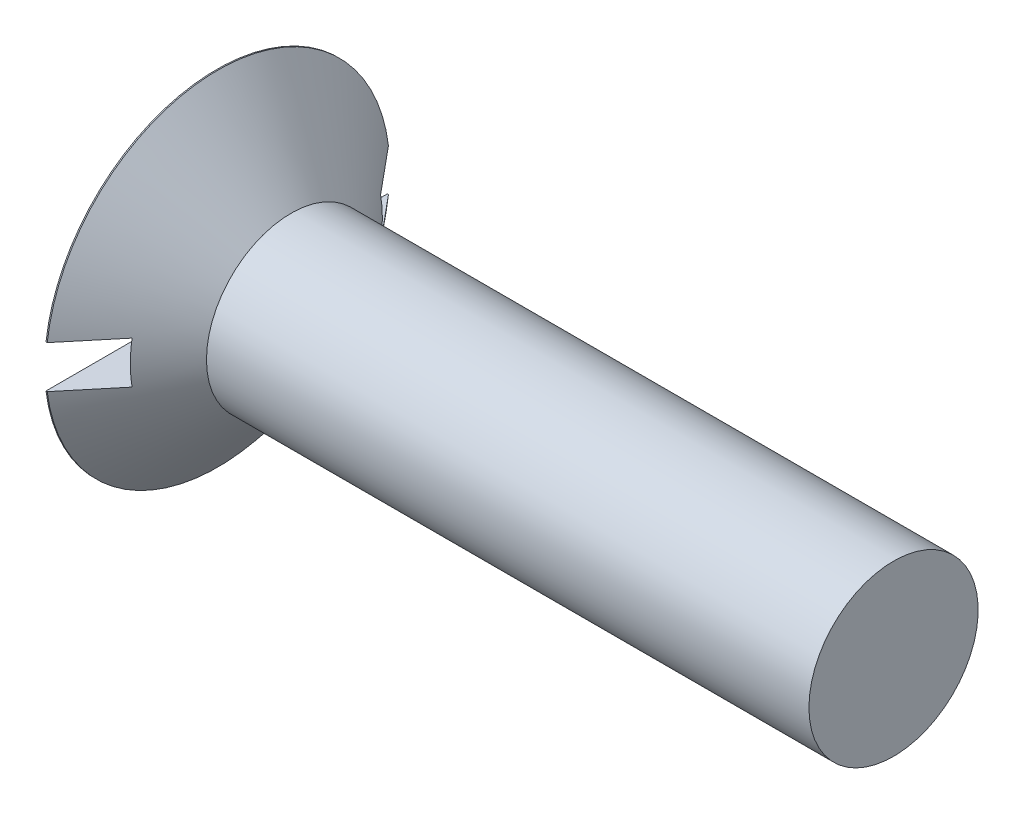
ISO-10303-21;
HEADER;
FILE_DESCRIPTION(('STEP AP214'),'2;1');
FILE_NAME('part.step','',(''),(''),'','','');
FILE_SCHEMA(('AUTOMOTIVE_DESIGN { 1 0 10303 214 1 1 1 1 }'));
ENDSEC;
DATA;
#1=APPLICATION_CONTEXT('core data for automotive mechanical design processes');
#2=APPLICATION_PROTOCOL_DEFINITION('international standard','automotive_design',2000,#1);
#3=PRODUCT_CONTEXT('',#1,'mechanical');
#4=PRODUCT('Part','Part','',(#3));
#5=PRODUCT_RELATED_PRODUCT_CATEGORY('part','',(#4));
#6=PRODUCT_DEFINITION_FORMATION('','',#4);
#7=PRODUCT_DEFINITION_CONTEXT('part definition',#1,'design');
#8=PRODUCT_DEFINITION('design','',#6,#7);
#9=PRODUCT_DEFINITION_SHAPE('','',#8);
#10=(LENGTH_UNIT() NAMED_UNIT(*) SI_UNIT(.MILLI.,.METRE.));
#11=(NAMED_UNIT(*) PLANE_ANGLE_UNIT() SI_UNIT($,.RADIAN.));
#12=(NAMED_UNIT(*) SI_UNIT($,.STERADIAN.) SOLID_ANGLE_UNIT());
#13=UNCERTAINTY_MEASURE_WITH_UNIT(LENGTH_MEASURE(1.E-05),#10,'distance_accuracy_value','');
#14=(GEOMETRIC_REPRESENTATION_CONTEXT(3) GLOBAL_UNCERTAINTY_ASSIGNED_CONTEXT((#13)) GLOBAL_UNIT_ASSIGNED_CONTEXT((#10,
#11,#12)) REPRESENTATION_CONTEXT('',''));
#15=CARTESIAN_POINT('',(0.,0.,0.));
#16=DIRECTION('',(0.,0.,1.));
#17=DIRECTION('',(1.,0.,0.));
#18=AXIS2_PLACEMENT_3D('',#15,#16,#17);
#19=CARTESIAN_POINT('',(2.2352,1.1938,-9.67739999999999));
#20=DIRECTION('',(-1.,0.,0.));
#21=DIRECTION('',(0.,0.,1.));
#22=AXIS2_PLACEMENT_3D('',#19,#20,#21);
#23=PLANE('',#22);
#24=DIRECTION('',(0.,-1.,0.));
#25=VECTOR('',#24,1.);
#26=CARTESIAN_POINT('',(2.2352,1.19379999999995,4.93366687898089));
#27=LINE('',#26,#25);
#28=CARTESIAN_POINT('',(2.2352,0.93915286624202,4.93366687898089));
#29=VERTEX_POINT('',#28);
#30=CARTESIAN_POINT('',(2.2352,-0.939152866242055,4.93366687898089));
#31=VERTEX_POINT('',#30);
#32=EDGE_CURVE('E316',#29,#31,#27,.T.);
#33=ORIENTED_EDGE('',*,*,#32,.T.);
#34=DIRECTION('',(0.,0.,-1.));
#35=VECTOR('',#34,1.);
#36=CARTESIAN_POINT('',(2.2352,-0.939152866242006,-9.6774));
#37=LINE('',#36,#35);
#38=CARTESIAN_POINT('',(2.2352,-0.939152866242041,0.939152866242038));
#39=VERTEX_POINT('',#38);
#40=EDGE_CURVE('E163',#31,#39,#37,.T.);
#41=ORIENTED_EDGE('',*,*,#40,.T.);
#42=DIRECTION('',(0.,-1.,0.));
#43=VECTOR('',#42,1.);
#44=CARTESIAN_POINT('',(2.2352,1.1938,0.939152866242037));
#45=LINE('',#44,#43);
#46=CARTESIAN_POINT('',(2.2352,-1.1938,0.939152866242037));
#47=VERTEX_POINT('',#46);
#48=EDGE_CURVE('E40',#39,#47,#45,.T.);
#49=ORIENTED_EDGE('',*,*,#48,.T.);
#50=DIRECTION('',(0.,0.,1.));
#51=VECTOR('',#50,1.);
#52=CARTESIAN_POINT('',(2.2352,-1.1938,-9.6774));
#53=LINE('',#52,#51);
#54=CARTESIAN_POINT('',(2.2352,-1.1938,6.99215244623282));
#55=VERTEX_POINT('',#54);
#56=EDGE_CURVE('E55',#47,#55,#53,.T.);
#57=ORIENTED_EDGE('',*,*,#56,.T.);
#58=CARTESIAN_POINT('',(2.2352,0.,0.));
#59=DIRECTION('',(-1.,0.,0.));
#60=DIRECTION('',(0.,0.,1.));
#61=AXIS2_PLACEMENT_3D('',#58,#59,#60);
#62=CIRCLE('',#61,7.09333167639577);
#63=CARTESIAN_POINT('',(2.2352,1.1938,6.99215244623282));
#64=VERTEX_POINT('',#63);
#65=EDGE_CURVE('E264',#64,#55,#62,.F.);
#66=ORIENTED_EDGE('',*,*,#65,.F.);
#67=DIRECTION('',(0.,0.,-1.));
#68=VECTOR('',#67,1.);
#69=CARTESIAN_POINT('',(2.2352,1.1938,9.6774));
#70=LINE('',#69,#68);
#71=CARTESIAN_POINT('',(2.2352,1.1938,0.939152866242037));
#72=VERTEX_POINT('',#71);
#73=EDGE_CURVE('E228',#64,#72,#70,.T.);
#74=ORIENTED_EDGE('',*,*,#73,.T.);
#75=CARTESIAN_POINT('',(2.2352,0.939152866242034,0.939152866242037));
#76=VERTEX_POINT('',#75);
#77=EDGE_CURVE('E11',#72,#76,#45,.T.);
#78=ORIENTED_EDGE('',*,*,#77,.T.);
#79=DIRECTION('',(0.,0.,1.));
#80=VECTOR('',#79,1.);
#81=CARTESIAN_POINT('',(2.2352,0.939152866242072,-9.67739999999999));
#82=LINE('',#81,#80);
#83=EDGE_CURVE('E317',#76,#29,#82,.T.);
#84=ORIENTED_EDGE('',*,*,#83,.T.);
#85=EDGE_LOOP('',(#33,#41,#49,#57,#66,#74,#78,#84));
#86=FACE_BOUND('',#85,.T.);
#87=ADVANCED_FACE('F32',(#86),#23,.T.);
#88=DIRECTION('',(0.,1.,0.));
#89=VECTOR('',#88,1.);
#90=CARTESIAN_POINT('',(2.2352,1.1938,-0.939152866242039));
#91=LINE('',#90,#89);
#92=CARTESIAN_POINT('',(2.2352,-1.1938,-0.939152866242039));
#93=VERTEX_POINT('',#92);
#94=CARTESIAN_POINT('',(2.2352,-0.939152866242035,-0.939152866242038));
#95=VERTEX_POINT('',#94);
#96=EDGE_CURVE('E389',#93,#95,#91,.T.);
#97=ORIENTED_EDGE('',*,*,#96,.T.);
#98=DIRECTION('',(0.,0.,-1.));
#99=VECTOR('',#98,1.);
#100=CARTESIAN_POINT('',(2.2352,-0.939152866242006,-9.6774));
#101=LINE('',#100,#99);
#102=CARTESIAN_POINT('',(2.2352,-0.939152866242022,-4.9336668789809));
#103=VERTEX_POINT('',#102);
#104=EDGE_CURVE('E189',#95,#103,#101,.T.);
#105=ORIENTED_EDGE('',*,*,#104,.T.);
#106=DIRECTION('',(0.,1.,0.));
#107=VECTOR('',#106,1.);
#108=CARTESIAN_POINT('',(2.2352,1.19379999999998,-4.93366687898089));
#109=LINE('',#108,#107);
#110=CARTESIAN_POINT('',(2.2352,0.939152866242055,-4.93366687898089));
#111=VERTEX_POINT('',#110);
#112=EDGE_CURVE('E332',#103,#111,#109,.T.);
#113=ORIENTED_EDGE('',*,*,#112,.T.);
#114=DIRECTION('',(0.,0.,1.));
#115=VECTOR('',#114,1.);
#116=CARTESIAN_POINT('',(2.2352,0.939152866242072,-9.67739999999999));
#117=LINE('',#116,#115);
#118=CARTESIAN_POINT('',(2.2352,0.939152866242041,-0.939152866242038));
#119=VERTEX_POINT('',#118);
#120=EDGE_CURVE('E322',#111,#119,#117,.T.);
#121=ORIENTED_EDGE('',*,*,#120,.T.);
#122=CARTESIAN_POINT('',(2.2352,1.1938,-0.939152866242035));
#123=VERTEX_POINT('',#122);
#124=EDGE_CURVE('E47',#119,#123,#91,.T.);
#125=ORIENTED_EDGE('',*,*,#124,.T.);
#126=CARTESIAN_POINT('',(2.2352,1.1938,-6.99215244623282));
#127=VERTEX_POINT('',#126);
#128=EDGE_CURVE('E231',#123,#127,#70,.T.);
#129=ORIENTED_EDGE('',*,*,#128,.T.);
#130=CARTESIAN_POINT('',(2.2352,-1.1938,-6.99215244623282));
#131=VERTEX_POINT('',#130);
#132=EDGE_CURVE('E268',#131,#127,#62,.F.);
#133=ORIENTED_EDGE('',*,*,#132,.F.);
#134=EDGE_CURVE('E232',#131,#93,#53,.T.);
#135=ORIENTED_EDGE('',*,*,#134,.T.);
#136=EDGE_LOOP('',(#97,#105,#113,#121,#125,#129,#133,#135));
#137=FACE_BOUND('',#136,.T.);
#138=ADVANCED_FACE('F311',(#137),#23,.T.);
#139=CARTESIAN_POINT('',(8.69008083333333,0.,0.497178541666667));
#140=DIRECTION('',(-0.0683113918583954,0.,-0.997664048536565));
#141=DIRECTION('',(-0.997664048536565,0.,0.0683113918583954));
#142=AXIS2_PLACEMENT_3D('',#139,#140,#141);
#143=PLANE('',#142);
#144=ORIENTED_EDGE('',*,*,#48,.F.);
#145=DIRECTION('',(0.995344390972083,0.0681525618022289,-0.0681525618022287));
#146=VECTOR('',#145,1.);
#147=CARTESIAN_POINT('',(8.72380707400527,-0.494869260856328,0.494869260856327));
#148=LINE('',#147,#146);
#149=CARTESIAN_POINT('',(7.9756,-0.546100000000002,0.546099999999999));
#150=VERTEX_POINT('',#149);
#151=EDGE_CURVE('E161',#39,#150,#148,.T.);
#152=ORIENTED_EDGE('',*,*,#151,.T.);
#153=DIRECTION('',(0.793328420082592,0.606365671400707,-0.0543202580629801));
#154=VECTOR('',#153,1.);
#155=CARTESIAN_POINT('',(0.,-6.6421,1.0922));
#156=LINE('',#155,#154);
#157=CARTESIAN_POINT('',(0.,-6.6421,1.0922));
#158=VERTEX_POINT('',#157);
#159=EDGE_CURVE('E186',#158,#150,#156,.T.);
#160=ORIENTED_EDGE('',*,*,#159,.F.);
#161=DIRECTION('',(0.,-1.,0.));
#162=VECTOR('',#161,1.);
#163=CARTESIAN_POINT('',(0.,6.6421,1.0922));
#164=LINE('',#163,#162);
#165=CARTESIAN_POINT('',(0.,-1.1938,1.0922));
#166=VERTEX_POINT('',#165);
#167=EDGE_CURVE('E344',#166,#158,#164,.T.);
#168=ORIENTED_EDGE('',*,*,#167,.F.);
#169=DIRECTION('',(0.997664048536565,0.,-0.0683113918583954));
#170=VECTOR('',#169,1.);
#171=CARTESIAN_POINT('',(2.95873739744039,-1.1938,0.889611292850418));
#172=LINE('',#171,#170);
#173=EDGE_CURVE('E223',#166,#47,#172,.T.);
#174=ORIENTED_EDGE('',*,*,#173,.T.);
#175=EDGE_LOOP('',(#144,#152,#160,#168,#174));
#176=FACE_BOUND('',#175,.T.);
#177=ADVANCED_FACE('F184',(#176),#143,.T.);
#178=DIRECTION('',(0.793328420082592,-0.606365671400707,-0.05432025806298));
#179=VECTOR('',#178,1.);
#180=CARTESIAN_POINT('',(0.,6.6421,1.0922));
#181=LINE('',#180,#179);
#182=CARTESIAN_POINT('',(0.,6.6421,1.0922));
#183=VERTEX_POINT('',#182);
#184=CARTESIAN_POINT('',(7.9756,0.546100000000001,0.5461));
#185=VERTEX_POINT('',#184);
#186=EDGE_CURVE('E209',#183,#185,#181,.T.);
#187=ORIENTED_EDGE('',*,*,#186,.T.);
#188=DIRECTION('',(-0.995344390972083,0.0681525618022283,0.0681525618022286));
#189=VECTOR('',#188,1.);
#190=CARTESIAN_POINT('',(8.72380707400527,0.494869260856325,0.494869260856327));
#191=LINE('',#190,#189);
#192=EDGE_CURVE('E328',#185,#76,#191,.T.);
#193=ORIENTED_EDGE('',*,*,#192,.T.);
#194=ORIENTED_EDGE('',*,*,#77,.F.);
#195=DIRECTION('',(-0.997664048536565,0.,0.0683113918583954));
#196=VECTOR('',#195,1.);
#197=CARTESIAN_POINT('',(1.63967255629894,1.1938,0.979929426877621));
#198=LINE('',#197,#196);
#199=CARTESIAN_POINT('',(0.,1.1938,1.0922));
#200=VERTEX_POINT('',#199);
#201=EDGE_CURVE('E225',#72,#200,#198,.T.);
#202=ORIENTED_EDGE('',*,*,#201,.T.);
#203=EDGE_CURVE('E345',#183,#200,#164,.T.);
#204=ORIENTED_EDGE('',*,*,#203,.F.);
#205=EDGE_LOOP('',(#187,#193,#194,#202,#204));
#206=FACE_BOUND('',#205,.T.);
#207=ADVANCED_FACE('F365',(#206),#143,.T.);
#208=CARTESIAN_POINT('',(8.69008083333333,0.,-0.497178541666667));
#209=DIRECTION('',(-0.0683113918583953,0.,0.997664048536565));
#210=DIRECTION('',(0.997664048536565,0.,0.0683113918583953));
#211=AXIS2_PLACEMENT_3D('',#208,#209,#210);
#212=PLANE('',#211);
#213=DIRECTION('',(0.793328420082592,0.606365671400707,0.0543202580629799));
#214=VECTOR('',#213,1.);
#215=CARTESIAN_POINT('',(0.,-6.6421,-1.0922));
#216=LINE('',#215,#214);
#217=CARTESIAN_POINT('',(0.,-6.6421,-1.0922));
#218=VERTEX_POINT('',#217);
#219=CARTESIAN_POINT('',(7.9756,-0.5461,-0.5461));
#220=VERTEX_POINT('',#219);
#221=EDGE_CURVE('E204',#218,#220,#216,.T.);
#222=ORIENTED_EDGE('',*,*,#221,.T.);
#223=DIRECTION('',(-0.995344390972083,-0.0681525618022284,-0.0681525618022285));
#224=VECTOR('',#223,1.);
#225=CARTESIAN_POINT('',(8.72380707400527,-0.494869260856325,-0.494869260856327));
#226=LINE('',#225,#224);
#227=EDGE_CURVE('E335',#220,#95,#226,.T.);
#228=ORIENTED_EDGE('',*,*,#227,.T.);
#229=ORIENTED_EDGE('',*,*,#96,.F.);
#230=DIRECTION('',(-0.997664048536565,0.,-0.0683113918583953));
#231=VECTOR('',#230,1.);
#232=CARTESIAN_POINT('',(1.63967255629895,-1.1938,-0.979929426877619));
#233=LINE('',#232,#231);
#234=CARTESIAN_POINT('',(0.,-1.1938,-1.0922));
#235=VERTEX_POINT('',#234);
#236=EDGE_CURVE('E219',#93,#235,#233,.T.);
#237=ORIENTED_EDGE('',*,*,#236,.T.);
#238=DIRECTION('',(0.,1.,0.));
#239=VECTOR('',#238,1.);
#240=CARTESIAN_POINT('',(0.,-6.6421,-1.0922));
#241=LINE('',#240,#239);
#242=EDGE_CURVE('E207',#218,#235,#241,.T.);
#243=ORIENTED_EDGE('',*,*,#242,.F.);
#244=EDGE_LOOP('',(#222,#228,#229,#237,#243));
#245=FACE_BOUND('',#244,.T.);
#246=ADVANCED_FACE('F388',(#245),#212,.T.);
#247=ORIENTED_EDGE('',*,*,#124,.F.);
#248=DIRECTION('',(0.995344390972083,-0.0681525618022288,0.0681525618022285));
#249=VECTOR('',#248,1.);
#250=CARTESIAN_POINT('',(8.72380707400527,0.494869260856329,-0.494869260856327));
#251=LINE('',#250,#249);
#252=CARTESIAN_POINT('',(7.9756,0.546100000000002,-0.546099999999998));
#253=VERTEX_POINT('',#252);
#254=EDGE_CURVE('E318',#119,#253,#251,.T.);
#255=ORIENTED_EDGE('',*,*,#254,.T.);
#256=DIRECTION('',(0.793328420082592,-0.606365671400707,0.0543202580629799));
#257=VECTOR('',#256,1.);
#258=CARTESIAN_POINT('',(0.,6.6421,-1.0922));
#259=LINE('',#258,#257);
#260=CARTESIAN_POINT('',(0.,6.6421,-1.0922));
#261=VERTEX_POINT('',#260);
#262=EDGE_CURVE('E198',#261,#253,#259,.T.);
#263=ORIENTED_EDGE('',*,*,#262,.F.);
#264=CARTESIAN_POINT('',(0.,1.1938,-1.0922));
#265=VERTEX_POINT('',#264);
#266=EDGE_CURVE('E203',#265,#261,#241,.T.);
#267=ORIENTED_EDGE('',*,*,#266,.F.);
#268=DIRECTION('',(0.997664048536565,0.,0.0683113918583953));
#269=VECTOR('',#268,1.);
#270=CARTESIAN_POINT('',(2.95873739744039,1.1938,-0.88961129285042));
#271=LINE('',#270,#269);
#272=EDGE_CURVE('E221',#265,#123,#271,.T.);
#273=ORIENTED_EDGE('',*,*,#272,.T.);
#274=EDGE_LOOP('',(#247,#255,#263,#267,#273));
#275=FACE_BOUND('',#274,.T.);
#276=ADVANCED_FACE('F375',(#275),#212,.T.);
#277=CARTESIAN_POINT('',(0.,0.,0.));
#278=DIRECTION('',(-1.,0.,0.));
#279=DIRECTION('',(0.,0.,1.));
#280=AXIS2_PLACEMENT_3D('',#277,#278,#279);
#281=PLANE('',#280);
#282=DIRECTION('',(0.,0.,1.));
#283=VECTOR('',#282,1.);
#284=CARTESIAN_POINT('',(0.,6.6421,-1.0922));
#285=LINE('',#284,#283);
#286=EDGE_CURVE('E341',#261,#183,#285,.T.);
#287=ORIENTED_EDGE('',*,*,#286,.T.);
#288=ORIENTED_EDGE('',*,*,#203,.T.);
#289=DIRECTION('',(0.,0.,-1.));
#290=VECTOR('',#289,1.);
#291=CARTESIAN_POINT('',(0.,1.1938,9.6774));
#292=LINE('',#291,#290);
#293=CARTESIAN_POINT('',(0.,1.1938,9.60348438432634));
#294=VERTEX_POINT('',#293);
#295=EDGE_CURVE('E236',#294,#200,#292,.T.);
#296=ORIENTED_EDGE('',*,*,#295,.F.);
#297=CARTESIAN_POINT('',(0.,0.,0.));
#298=DIRECTION('',(-1.,0.,0.));
#299=DIRECTION('',(0.,0.,1.));
#300=AXIS2_PLACEMENT_3D('',#297,#298,#299);
#301=CIRCLE('',#300,9.6774);
#302=CARTESIAN_POINT('',(0.,1.1938,-9.60348438432634));
#303=VERTEX_POINT('',#302);
#304=EDGE_CURVE('E263',#294,#303,#301,.T.);
#305=ORIENTED_EDGE('',*,*,#304,.T.);
#306=EDGE_CURVE('E227',#265,#303,#292,.T.);
#307=ORIENTED_EDGE('',*,*,#306,.F.);
#308=ORIENTED_EDGE('',*,*,#266,.T.);
#309=EDGE_LOOP('',(#287,#288,#296,#305,#307,#308));
#310=FACE_BOUND('',#309,.T.);
#311=ADVANCED_FACE('F34',(#310),#281,.T.);
#312=DIRECTION('',(0.,0.,1.));
#313=VECTOR('',#312,1.);
#314=CARTESIAN_POINT('',(0.,-1.1938,-9.6774));
#315=LINE('',#314,#313);
#316=CARTESIAN_POINT('',(0.,-1.1938,9.60348438432634));
#317=VERTEX_POINT('',#316);
#318=EDGE_CURVE('E239',#166,#317,#315,.T.);
#319=ORIENTED_EDGE('',*,*,#318,.F.);
#320=ORIENTED_EDGE('',*,*,#167,.T.);
#321=DIRECTION('',(0.,0.,-1.));
#322=VECTOR('',#321,1.);
#323=CARTESIAN_POINT('',(0.,-6.6421,1.0922));
#324=LINE('',#323,#322);
#325=EDGE_CURVE('E202',#158,#218,#324,.T.);
#326=ORIENTED_EDGE('',*,*,#325,.T.);
#327=ORIENTED_EDGE('',*,*,#242,.T.);
#328=CARTESIAN_POINT('',(0.,-1.1938,-9.60348438432634));
#329=VERTEX_POINT('',#328);
#330=EDGE_CURVE('E240',#329,#235,#315,.T.);
#331=ORIENTED_EDGE('',*,*,#330,.F.);
#332=EDGE_CURVE('E260',#329,#317,#301,.T.);
#333=ORIENTED_EDGE('',*,*,#332,.T.);
#334=EDGE_LOOP('',(#319,#320,#326,#327,#331,#333));
#335=FACE_BOUND('',#334,.T.);
#336=ADVANCED_FACE('F296',(#335),#281,.T.);
#337=CARTESIAN_POINT('',(2.2352,1.1938,9.6774));
#338=DIRECTION('',(0.,1.,0.));
#339=DIRECTION('',(0.,0.,1.));
#340=AXIS2_PLACEMENT_3D('',#337,#338,#339);
#341=PLANE('',#340);
#342=ORIENTED_EDGE('',*,*,#201,.F.);
#343=ORIENTED_EDGE('',*,*,#73,.F.);
#344=CARTESIAN_POINT('',(-9.76654593164914,1.1938,-21.3631259383791));
#345=CARTESIAN_POINT('',(-9.09525937896427,1.1938,-20.5618561872628));
#346=CARTESIAN_POINT('',(-8.42402942184396,1.1938,-19.7605389922674));
#347=CARTESIAN_POINT('',(-7.08174656529873,1.1938,-18.1577081627407));
#348=CARTESIAN_POINT('',(-6.410693672967,1.1938,-17.3561945222694));
#349=CARTESIAN_POINT('',(-5.06835999478434,1.1938,-15.7523090009415));
#350=CARTESIAN_POINT('',(-4.39707943091826,1.1938,-14.9499369342687));
#351=CARTESIAN_POINT('',(-3.05500547673589,1.1938,-13.344832799566));
#352=CARTESIAN_POINT('',(-2.38421207030888,1.1938,-12.5421007450077));
#353=CARTESIAN_POINT('',(-1.08974214453766,1.1938,-10.9914684766259));
#354=CARTESIAN_POINT('',(-0.466012830989507,1.1938,-10.2436123638055));
#355=CARTESIAN_POINT('',(0.468629921489954,1.1938,-9.12096941168539));
#356=CARTESIAN_POINT('',(0.780035340405337,1.1938,-8.74659222952008));
#357=CARTESIAN_POINT('',(1.40235767845507,1.1938,-7.99743946742865));
#358=CARTESIAN_POINT('',(1.7132746034181,1.1938,-7.62266389234697));
#359=CARTESIAN_POINT('',(2.33421374657034,1.1938,-6.87268523520887));
#360=CARTESIAN_POINT('',(2.64423633183312,1.1938,-6.49748245710988));
#361=CARTESIAN_POINT('',(3.26310212902537,1.1938,-5.74607511705371));
#362=CARTESIAN_POINT('',(3.57194528724139,1.1938,-5.36987051076495));
#363=CARTESIAN_POINT('',(4.03353158308518,1.1938,-4.80425158466736));
#364=CARTESIAN_POINT('',(4.18709974598508,1.1938,-4.61551087670477));
#365=CARTESIAN_POINT('',(4.4934425309929,1.1938,-4.23738693696583));
#366=CARTESIAN_POINT('',(4.64621715651197,1.1938,-4.04800370795726));
#367=CARTESIAN_POINT('',(4.95058145187337,1.1938,-3.66830924323743));
#368=CARTESIAN_POINT('',(5.10217120583669,1.1938,-3.47799807499275));
#369=CARTESIAN_POINT('',(5.40351985730696,1.1938,-3.09593308429033));
#370=CARTESIAN_POINT('',(5.55327881261173,1.1938,-2.90417930768568));
#371=CARTESIAN_POINT('',(5.73503949390202,1.1938,-2.66748522542514));
#372=CARTESIAN_POINT('',(5.7685380756654,1.1938,-2.62369463527218));
#373=CARTESIAN_POINT('',(5.83534437577694,1.1938,-2.53596777529053));
#374=CARTESIAN_POINT('',(5.86865209308634,1.1938,-2.49203150467103));
#375=CARTESIAN_POINT('',(5.96825558737328,1.1938,-2.35996763028417));
#376=CARTESIAN_POINT('',(6.03422528026107,1.1938,-2.27159331182579));
#377=CARTESIAN_POINT('',(6.16555986291181,1.1938,-2.09319681022266));
#378=CARTESIAN_POINT('',(6.23091437982306,1.1938,-2.00316697271865));
#379=CARTESIAN_POINT('',(6.35992402493566,1.1938,-1.82192968945906));
#380=CARTESIAN_POINT('',(6.42357962679466,1.1938,-1.73072258267316));
#381=CARTESIAN_POINT('',(6.54895917751627,1.1938,-1.54585737920636));
#382=CARTESIAN_POINT('',(6.61066232471778,1.1938,-1.4521851040837));
#383=CARTESIAN_POINT('',(6.73033793041619,1.1938,-1.2622703295857));
#384=CARTESIAN_POINT('',(6.78830535652416,1.1938,-1.16602460050921));
#385=CARTESIAN_POINT('',(6.87032154010654,1.1938,-1.01940163786976));
#386=CARTESIAN_POINT('',(6.89673746242748,1.1938,-0.970361294352432));
#387=CARTESIAN_POINT('',(6.94753509366566,1.1938,-0.871242137065955));
#388=CARTESIAN_POINT('',(6.97191636263843,1.1938,-0.821163101612474));
#389=CARTESIAN_POINT('',(7.04101569893722,1.1938,-0.669329881550796));
#390=CARTESIAN_POINT('',(7.08187978249657,1.1938,-0.565655074895694));
#391=CARTESIAN_POINT('',(7.12649625042963,1.1938,-0.417525005421813));
#392=CARTESIAN_POINT('',(7.13772030765905,1.1938,-0.375315946700828));
#393=CARTESIAN_POINT('',(7.15690825639771,1.1938,-0.290148086197976));
#394=CARTESIAN_POINT('',(7.16487217380331,1.1938,-0.247189290374345));
#395=CARTESIAN_POINT('',(7.17705987506851,1.1938,-0.160931262036987));
#396=CARTESIAN_POINT('',(7.18130019489879,1.1938,-0.117634405031509));
#397=CARTESIAN_POINT('',(7.18581997140462,1.1938,-0.030832058426957));
#398=CARTESIAN_POINT('',(7.18609962730917,1.1938,0.0126734205679055));
#399=CARTESIAN_POINT('',(7.18267879720996,1.1938,0.0995364340264362));
#400=CARTESIAN_POINT('',(7.17897720385541,1.1938,0.142893923962498));
#401=CARTESIAN_POINT('',(7.16783852752721,1.1938,0.22912857614983));
#402=CARTESIAN_POINT('',(7.16040045523447,1.1938,0.272005608113391));
#403=CARTESIAN_POINT('',(7.14217709888898,1.1938,0.357256963356369));
#404=CARTESIAN_POINT('',(7.13137514507676,1.1938,0.399627667052179));
#405=CARTESIAN_POINT('',(7.10695142432286,1.1938,0.483527898356984));
#406=CARTESIAN_POINT('',(7.09333011278445,1.1938,0.525057560629227));
#407=CARTESIAN_POINT('',(7.05155357221496,1.1938,0.641262683137301));
#408=CARTESIAN_POINT('',(7.02069143144381,1.1938,0.714961370983389));
#409=CARTESIAN_POINT('',(6.95370460919302,1.1938,0.859951367703668));
#410=CARTESIAN_POINT('',(6.91757377890332,1.1938,0.931239742212288));
#411=CARTESIAN_POINT('',(6.84158229234983,1.1938,1.07213929396108));
#412=CARTESIAN_POINT('',(6.8017076271369,1.1938,1.1417428379471));
#413=CARTESIAN_POINT('',(6.71946088773381,1.1938,1.27940009701406));
#414=CARTESIAN_POINT('',(6.67708995170407,1.1938,1.34745449909286));
#415=CARTESIAN_POINT('',(6.59004307470819,1.1938,1.48318189948864));
#416=CARTESIAN_POINT('',(6.54534611851474,1.1938,1.55084134781466));
#417=CARTESIAN_POINT('',(6.45459267427967,1.1938,1.68524729097075));
#418=CARTESIAN_POINT('',(6.40853606204154,1.1938,1.75199370158028));
#419=CARTESIAN_POINT('',(6.31551801715652,1.1938,1.88460319658263));
#420=CARTESIAN_POINT('',(6.26855912382869,1.1938,1.95046806699276));
#421=CARTESIAN_POINT('',(6.17385893762874,1.1938,2.08162757987046));
#422=CARTESIAN_POINT('',(6.12611767670795,1.1938,2.14692224545868));
#423=CARTESIAN_POINT('',(5.98410270480832,1.1938,2.33925290234635));
#424=CARTESIAN_POINT('',(5.88896693615855,1.1938,2.46565184130851));
#425=CARTESIAN_POINT('',(5.69717733241732,1.1938,2.71729450061666));
#426=CARTESIAN_POINT('',(5.60052343881201,1.1938,2.84253817613797));
#427=CARTESIAN_POINT('',(5.40615432485477,1.1938,3.09222128667674));
#428=CARTESIAN_POINT('',(5.3084389844418,1.1938,3.21666062812194));
#429=CARTESIAN_POINT('',(5.11225222530464,1.1938,3.46494232473053));
#430=CARTESIAN_POINT('',(5.01378080129256,1.1938,3.58878467570881));
#431=CARTESIAN_POINT('',(4.71730922276824,1.1938,3.95993661980435));
#432=CARTESIAN_POINT('',(4.51847832872609,1.1938,4.20658220685805));
#433=CARTESIAN_POINT('',(4.11953298785207,1.1938,4.69880256251826));
#434=CARTESIAN_POINT('',(3.91941862833605,1.1938,4.94437740209921));
#435=CARTESIAN_POINT('',(3.5206079257574,1.1938,5.43207466293573));
#436=CARTESIAN_POINT('',(3.32192101760866,1.1938,5.67420480254497));
#437=CARTESIAN_POINT('',(2.92398116297745,1.1938,6.15800627813389));
#438=CARTESIAN_POINT('',(2.72472820660201,1.1938,6.39967760597011));
#439=CARTESIAN_POINT('',(2.12655720032303,1.1938,7.12398599686623));
#440=CARTESIAN_POINT('',(1.72704846978454,1.1938,7.60613510378071));
#441=CARTESIAN_POINT('',(0.871046814390529,1.1938,8.63731923425454));
#442=CARTESIAN_POINT('',(0.414424045188316,1.1938,9.18624635470308));
#443=CARTESIAN_POINT('',(-0.499483291949515,1.1938,10.2835513722639));
#444=CARTESIAN_POINT('',(-0.956767861379946,1.1938,10.831929268131));
#445=CARTESIAN_POINT('',(-2.32939847374108,1.1938,12.4767584040929));
#446=CARTESIAN_POINT('',(-3.245352534256,1.1938,13.5727021058739));
#447=CARTESIAN_POINT('',(-5.0953514620824,1.1938,15.7847101010366));
#448=CARTESIAN_POINT('',(-6.02941052973187,1.1938,16.9007625112222));
#449=CARTESIAN_POINT('',(-7.43073742945755,1.1938,18.5744595203244));
#450=CARTESIAN_POINT('',(-7.89784127784284,1.1938,19.132241416059));
#451=CARTESIAN_POINT('',(-8.83213491623697,1.1938,20.247732968874));
#452=CARTESIAN_POINT('',(-9.29932470622239,1.1938,20.805442625974));
#453=CARTESIAN_POINT('',(-9.76654593164914,1.1938,21.3631259383791));
#454=B_SPLINE_CURVE_WITH_KNOTS('',3,(#344,#345,#346,#347,#348,#349,#350,#351,#352,#353,#354,
#355,#356,#357,#358,#359,#360,#361,#362,#363,#364,#365,#366,#367,#368,#369,#370,#371,#372,#373,
#374,#375,#376,#377,#378,#379,#380,#381,#382,#383,#384,#385,#386,#387,#388,#389,#390,#391,#392,
#393,#394,#395,#396,#397,#398,#399,#400,#401,#402,#403,#404,#405,#406,#407,#408,#409,#410,#411,
#412,#413,#414,#415,#416,#417,#418,#419,#420,#421,#422,#423,#424,#425,#426,#427,#428,#429,#430,
#431,#432,#433,#434,#435,#436,#437,#438,#439,#440,#441,#442,#443,#444,#445,#446,#447,#448,#449,
#450,#451,#452,#453),.UNSPECIFIED.,.F.,.F.,(4,2,2,2,2,2,2,2,2,2,2,2,2,2,2,2,2,2,2,2,2,2,2,2,2,2,
2,2,2,2,2,2,2,2,2,2,2,2,2,2,2,2,2,2,2,2,2,2,2,2,2,2,2,2,4),(0.,3.13590972967681,
6.27193024983931,9.41036393077615,12.5486886077346,15.4701501185137,16.9310347189183,
18.3919017536911,19.852044722728,21.3122534149416,22.0422220793259,22.7721876032245,
23.5021008230668,24.231990939925,24.39739280978,24.5627955789655,24.8936327210894,
25.2273703299122,25.5610138995455,25.8974694346029,26.2343691227893,26.4014275322947,
26.5685219710389,26.9015846025692,27.0325102656921,27.163434888809,27.2937751103023,
27.4241087754088,27.554478701098,27.6848831634443,27.815944415997,27.946984515076,
28.1863394742223,28.4259760413417,28.6665480374595,28.9070111825094,29.150259810119,
29.3935307262178,29.6361957345903,29.8788508572731,30.3534327917803,30.8280330634426,
31.3026875883677,31.7773454359548,32.7277625128649,33.6781156033537,34.6177585666301,
35.5574180545877,37.4358925293251,39.5779535130433,41.7200193426254,46.0049431725074,
50.3709886613029,52.5535925619314,54.7361958687159),.UNSPECIFIED.);
#455=CARTESIAN_POINT('',(0.0669092227268023,1.1938,9.60348438432635));
#456=VERTEX_POINT('',#455);
#457=EDGE_CURVE('E275',#64,#456,#454,.T.);
#458=ORIENTED_EDGE('',*,*,#457,.T.);
#459=DIRECTION('',(-1.,0.,0.));
#460=VECTOR('',#459,1.);
#461=CARTESIAN_POINT('',(-6.34999999999999,1.1938,9.60348438432634));
#462=LINE('',#461,#460);
#463=EDGE_CURVE('E246',#456,#294,#462,.T.);
#464=ORIENTED_EDGE('',*,*,#463,.T.);
#465=ORIENTED_EDGE('',*,*,#295,.T.);
#466=EDGE_LOOP('',(#342,#343,#458,#464,#465));
#467=FACE_BOUND('',#466,.T.);
#468=ADVANCED_FACE('F292',(#467),#341,.F.);
#469=ORIENTED_EDGE('',*,*,#272,.F.);
#470=ORIENTED_EDGE('',*,*,#306,.T.);
#471=DIRECTION('',(-1.,0.,0.));
#472=VECTOR('',#471,1.);
#473=CARTESIAN_POINT('',(-6.34999999999999,1.1938,-9.60348438432634));
#474=LINE('',#473,#472);
#475=CARTESIAN_POINT('',(0.0669092227268023,1.1938,-9.60348438432635));
#476=VERTEX_POINT('',#475);
#477=EDGE_CURVE('E248',#303,#476,#474,.F.);
#478=ORIENTED_EDGE('',*,*,#477,.T.);
#479=EDGE_CURVE('E392',#476,#127,#454,.T.);
#480=ORIENTED_EDGE('',*,*,#479,.T.);
#481=ORIENTED_EDGE('',*,*,#128,.F.);
#482=EDGE_LOOP('',(#469,#470,#478,#480,#481));
#483=FACE_BOUND('',#482,.T.);
#484=ADVANCED_FACE('F289',(#483),#341,.F.);
#485=CARTESIAN_POINT('',(2.2352,-1.1938,-9.6774));
#486=DIRECTION('',(0.,-1.,0.));
#487=DIRECTION('',(0.,0.,-1.));
#488=AXIS2_PLACEMENT_3D('',#485,#486,#487);
#489=PLANE('',#488);
#490=ORIENTED_EDGE('',*,*,#173,.F.);
#491=ORIENTED_EDGE('',*,*,#318,.T.);
#492=DIRECTION('',(-1.,0.,0.));
#493=VECTOR('',#492,1.);
#494=CARTESIAN_POINT('',(-6.34999999999999,-1.1938,9.60348438432634));
#495=LINE('',#494,#493);
#496=CARTESIAN_POINT('',(0.0669092227268015,-1.1938,9.60348438432635));
#497=VERTEX_POINT('',#496);
#498=EDGE_CURVE('E244',#317,#497,#495,.F.);
#499=ORIENTED_EDGE('',*,*,#498,.T.);
#500=CARTESIAN_POINT('',(-9.76654593164914,-1.1938,21.3631259383791));
#501=CARTESIAN_POINT('',(-9.09525937896427,-1.1938,20.5618561872628));
#502=CARTESIAN_POINT('',(-8.42402942184396,-1.1938,19.7605389922674));
#503=CARTESIAN_POINT('',(-7.08174656529873,-1.1938,18.1577081627407));
#504=CARTESIAN_POINT('',(-6.410693672967,-1.1938,17.3561945222694));
#505=CARTESIAN_POINT('',(-5.06835999478434,-1.1938,15.7523090009415));
#506=CARTESIAN_POINT('',(-4.39707943091826,-1.1938,14.9499369342687));
#507=CARTESIAN_POINT('',(-3.05500547673589,-1.1938,13.344832799566));
#508=CARTESIAN_POINT('',(-2.38421207030888,-1.1938,12.5421007450077));
#509=CARTESIAN_POINT('',(-1.08974214453767,-1.1938,10.9914684766259));
#510=CARTESIAN_POINT('',(-0.466012830989514,-1.1938,10.2436123638055));
#511=CARTESIAN_POINT('',(0.468629921489947,-1.1938,9.1209694116854));
#512=CARTESIAN_POINT('',(0.78003534040533,-1.1938,8.74659222952009));
#513=CARTESIAN_POINT('',(1.40235767845506,-1.1938,7.99743946742866));
#514=CARTESIAN_POINT('',(1.71327460341809,-1.1938,7.62266389234698));
#515=CARTESIAN_POINT('',(2.33421374657034,-1.1938,6.87268523520888));
#516=CARTESIAN_POINT('',(2.64423633183312,-1.1938,6.49748245710989));
#517=CARTESIAN_POINT('',(3.26310212902536,-1.1938,5.74607511705372));
#518=CARTESIAN_POINT('',(3.57194528724138,-1.1938,5.36987051076495));
#519=CARTESIAN_POINT('',(4.03353158308518,-1.1938,4.80425158466736));
#520=CARTESIAN_POINT('',(4.18709974598507,-1.1938,4.61551087670478));
#521=CARTESIAN_POINT('',(4.4934425309929,-1.1938,4.23738693696584));
#522=CARTESIAN_POINT('',(4.64621715651197,-1.1938,4.04800370795726));
#523=CARTESIAN_POINT('',(4.95058145187336,-1.1938,3.66830924323743));
#524=CARTESIAN_POINT('',(5.10217120583669,-1.1938,3.47799807499276));
#525=CARTESIAN_POINT('',(5.40351985730696,-1.1938,3.09593308429033));
#526=CARTESIAN_POINT('',(5.55327881261173,-1.1938,2.90417930768568));
#527=CARTESIAN_POINT('',(5.73503949390202,-1.1938,2.66748522542514));
#528=CARTESIAN_POINT('',(5.7685380756654,-1.1938,2.62369463527218));
#529=CARTESIAN_POINT('',(5.83534437577694,-1.1938,2.53596777529053));
#530=CARTESIAN_POINT('',(5.86865209308634,-1.1938,2.49203150467103));
#531=CARTESIAN_POINT('',(5.96825558737327,-1.1938,2.35996763028417));
#532=CARTESIAN_POINT('',(6.03422528026106,-1.1938,2.2715933118258));
#533=CARTESIAN_POINT('',(6.1655598629118,-1.1938,2.09319681022266));
#534=CARTESIAN_POINT('',(6.23091437982306,-1.1938,2.00316697271865));
#535=CARTESIAN_POINT('',(6.35992402493566,-1.1938,1.82192968945906));
#536=CARTESIAN_POINT('',(6.42357962679466,-1.1938,1.73072258267317));
#537=CARTESIAN_POINT('',(6.54895917751627,-1.1938,1.54585737920636));
#538=CARTESIAN_POINT('',(6.61066232471778,-1.1938,1.4521851040837));
#539=CARTESIAN_POINT('',(6.73033793041618,-1.1938,1.2622703295857));
#540=CARTESIAN_POINT('',(6.78830535652416,-1.1938,1.16602460050921));
#541=CARTESIAN_POINT('',(6.87032154010654,-1.1938,1.01940163786976));
#542=CARTESIAN_POINT('',(6.89673746242748,-1.1938,0.970361294352432));
#543=CARTESIAN_POINT('',(6.94753509366565,-1.1938,0.871242137065955));
#544=CARTESIAN_POINT('',(6.97191636263843,-1.1938,0.821163101612474));
#545=CARTESIAN_POINT('',(7.04101569893722,-1.1938,0.669329881550796));
#546=CARTESIAN_POINT('',(7.08187978249657,-1.1938,0.565655074895694));
#547=CARTESIAN_POINT('',(7.12649625042963,-1.1938,0.417525005421814));
#548=CARTESIAN_POINT('',(7.13772030765905,-1.1938,0.37531594670083));
#549=CARTESIAN_POINT('',(7.15690825639771,-1.1938,0.290148086197978));
#550=CARTESIAN_POINT('',(7.16487217380331,-1.1938,0.247189290374347));
#551=CARTESIAN_POINT('',(7.17705987506851,-1.1938,0.160931262036987));
#552=CARTESIAN_POINT('',(7.18130019489879,-1.1938,0.117634405031509));
#553=CARTESIAN_POINT('',(7.18581997140462,-1.1938,0.0308320584269568));
#554=CARTESIAN_POINT('',(7.18609962730917,-1.1938,-0.0126734205679058));
#555=CARTESIAN_POINT('',(7.18267879720996,-1.1938,-0.0995364340264367));
#556=CARTESIAN_POINT('',(7.17897720385541,-1.1938,-0.142893923962499));
#557=CARTESIAN_POINT('',(7.16783852752721,-1.1938,-0.22912857614983));
#558=CARTESIAN_POINT('',(7.16040045523447,-1.1938,-0.272005608113391));
#559=CARTESIAN_POINT('',(7.14217709888898,-1.1938,-0.35725696335637));
#560=CARTESIAN_POINT('',(7.13137514507676,-1.1938,-0.39962766705218));
#561=CARTESIAN_POINT('',(7.10695142432286,-1.1938,-0.483527898356984));
#562=CARTESIAN_POINT('',(7.09333011278445,-1.1938,-0.525057560629228));
#563=CARTESIAN_POINT('',(7.05155357221496,-1.1938,-0.641262683137302));
#564=CARTESIAN_POINT('',(7.02069143144381,-1.1938,-0.714961370983389));
#565=CARTESIAN_POINT('',(6.95370460919302,-1.1938,-0.859951367703669));
#566=CARTESIAN_POINT('',(6.91757377890332,-1.1938,-0.93123974221229));
#567=CARTESIAN_POINT('',(6.84158229234983,-1.1938,-1.07213929396108));
#568=CARTESIAN_POINT('',(6.8017076271369,-1.1938,-1.14174283794711));
#569=CARTESIAN_POINT('',(6.71946088773381,-1.1938,-1.27940009701407));
#570=CARTESIAN_POINT('',(6.67708995170407,-1.1938,-1.34745449909286));
#571=CARTESIAN_POINT('',(6.59004307470819,-1.1938,-1.48318189948865));
#572=CARTESIAN_POINT('',(6.54534611851474,-1.1938,-1.55084134781466));
#573=CARTESIAN_POINT('',(6.45459267427966,-1.1938,-1.68524729097076));
#574=CARTESIAN_POINT('',(6.40853606204154,-1.1938,-1.75199370158028));
#575=CARTESIAN_POINT('',(6.31551801715652,-1.1938,-1.88460319658264));
#576=CARTESIAN_POINT('',(6.26855912382868,-1.1938,-1.95046806699276));
#577=CARTESIAN_POINT('',(6.17385893762873,-1.1938,-2.08162757987046));
#578=CARTESIAN_POINT('',(6.12611767670795,-1.1938,-2.14692224545868));
#579=CARTESIAN_POINT('',(5.98410270480832,-1.1938,-2.33925290234635));
#580=CARTESIAN_POINT('',(5.88896693615855,-1.1938,-2.46565184130851));
#581=CARTESIAN_POINT('',(5.69717733241731,-1.1938,-2.71729450061666));
#582=CARTESIAN_POINT('',(5.600523438812,-1.1938,-2.84253817613797));
#583=CARTESIAN_POINT('',(5.40615432485477,-1.1938,-3.09222128667674));
#584=CARTESIAN_POINT('',(5.3084389844418,-1.1938,-3.21666062812194));
#585=CARTESIAN_POINT('',(5.11225222530464,-1.1938,-3.46494232473053));
#586=CARTESIAN_POINT('',(5.01378080129256,-1.1938,-3.58878467570881));
#587=CARTESIAN_POINT('',(4.71730922276824,-1.1938,-3.95993661980435));
#588=CARTESIAN_POINT('',(4.51847832872609,-1.1938,-4.20658220685806));
#589=CARTESIAN_POINT('',(4.11953298785207,-1.1938,-4.69880256251826));
#590=CARTESIAN_POINT('',(3.91941862833605,-1.1938,-4.94437740209921));
#591=CARTESIAN_POINT('',(3.52060792575739,-1.1938,-5.43207466293573));
#592=CARTESIAN_POINT('',(3.32192101760865,-1.1938,-5.67420480254497));
#593=CARTESIAN_POINT('',(2.92398116297745,-1.1938,-6.15800627813389));
#594=CARTESIAN_POINT('',(2.72472820660201,-1.1938,-6.39967760597011));
#595=CARTESIAN_POINT('',(2.12655720032303,-1.1938,-7.12398599686623));
#596=CARTESIAN_POINT('',(1.72704846978453,-1.1938,-7.60613510378072));
#597=CARTESIAN_POINT('',(0.871046814390522,-1.1938,-8.63731923425455));
#598=CARTESIAN_POINT('',(0.414424045188309,-1.1938,-9.18624635470309));
#599=CARTESIAN_POINT('',(-0.499483291949521,-1.1938,-10.2835513722639));
#600=CARTESIAN_POINT('',(-0.956767861379952,-1.1938,-10.831929268131));
#601=CARTESIAN_POINT('',(-2.32939847374108,-1.1938,-12.4767584040929));
#602=CARTESIAN_POINT('',(-3.24535253425601,-1.1938,-13.5727021058739));
#603=CARTESIAN_POINT('',(-5.09535146208241,-1.1938,-15.7847101010366));
#604=CARTESIAN_POINT('',(-6.02941052973188,-1.1938,-16.9007625112222));
#605=CARTESIAN_POINT('',(-7.43073742945755,-1.1938,-18.5744595203244));
#606=CARTESIAN_POINT('',(-7.89784127784284,-1.1938,-19.132241416059));
#607=CARTESIAN_POINT('',(-8.83213491623697,-1.1938,-20.247732968874));
#608=CARTESIAN_POINT('',(-9.29932470622239,-1.1938,-20.805442625974));
#609=CARTESIAN_POINT('',(-9.76654593164914,-1.1938,-21.3631259383791));
#610=B_SPLINE_CURVE_WITH_KNOTS('',3,(#500,#501,#502,#503,#504,#505,#506,#507,#508,#509,#510,
#511,#512,#513,#514,#515,#516,#517,#518,#519,#520,#521,#522,#523,#524,#525,#526,#527,#528,#529,
#530,#531,#532,#533,#534,#535,#536,#537,#538,#539,#540,#541,#542,#543,#544,#545,#546,#547,#548,
#549,#550,#551,#552,#553,#554,#555,#556,#557,#558,#559,#560,#561,#562,#563,#564,#565,#566,#567,
#568,#569,#570,#571,#572,#573,#574,#575,#576,#577,#578,#579,#580,#581,#582,#583,#584,#585,#586,
#587,#588,#589,#590,#591,#592,#593,#594,#595,#596,#597,#598,#599,#600,#601,#602,#603,#604,#605,
#606,#607,#608,#609),.UNSPECIFIED.,.F.,.F.,(4,2,2,2,2,2,2,2,2,2,2,2,2,2,2,2,2,2,2,2,2,2,2,2,2,2,
2,2,2,2,2,2,2,2,2,2,2,2,2,2,2,2,2,2,2,2,2,2,2,2,2,2,2,2,4),(0.,3.1359097296768,6.2719302498393,
9.41036393077614,12.5486886077346,15.4701501185137,16.9310347189183,18.391901753691,
19.852044722728,21.3122534149416,22.0422220793259,22.7721876032245,23.5021008230668,
24.231990939925,24.39739280978,24.5627955789655,24.8936327210894,25.2273703299122,
25.5610138995455,25.8974694346029,26.2343691227893,26.4014275322946,26.5685219710389,
26.9015846025692,27.0325102656921,27.163434888809,27.2937751103023,27.4241087754088,
27.554478701098,27.6848831634443,27.815944415997,27.946984515076,28.1863394742223,
28.4259760413417,28.6665480374595,28.9070111825094,29.150259810119,29.3935307262178,
29.6361957345903,29.8788508572731,30.3534327917803,30.8280330634426,31.3026875883677,
31.7773454359548,32.7277625128649,33.6781156033537,34.6177585666301,35.5574180545877,
37.4358925293251,39.5779535130433,41.7200193426254,46.0049431725074,50.3709886613029,
52.5535925619314,54.7361958687159),.UNSPECIFIED.);
#611=EDGE_CURVE('E267',#497,#55,#610,.T.);
#612=ORIENTED_EDGE('',*,*,#611,.T.);
#613=ORIENTED_EDGE('',*,*,#56,.F.);
#614=EDGE_LOOP('',(#490,#491,#499,#612,#613));
#615=FACE_BOUND('',#614,.T.);
#616=ADVANCED_FACE('F284',(#615),#489,.F.);
#617=ORIENTED_EDGE('',*,*,#236,.F.);
#618=ORIENTED_EDGE('',*,*,#134,.F.);
#619=CARTESIAN_POINT('',(0.0669092227268023,-1.1938,-9.60348438432635));
#620=VERTEX_POINT('',#619);
#621=EDGE_CURVE('E276',#131,#620,#610,.T.);
#622=ORIENTED_EDGE('',*,*,#621,.T.);
#623=DIRECTION('',(-1.,0.,0.));
#624=VECTOR('',#623,1.);
#625=CARTESIAN_POINT('',(-6.34999999999999,-1.1938,-9.60348438432634));
#626=LINE('',#625,#624);
#627=EDGE_CURVE('E235',#620,#329,#626,.T.);
#628=ORIENTED_EDGE('',*,*,#627,.T.);
#629=ORIENTED_EDGE('',*,*,#330,.T.);
#630=EDGE_LOOP('',(#617,#618,#622,#628,#629));
#631=FACE_BOUND('',#630,.T.);
#632=ADVANCED_FACE('F288',(#631),#489,.F.);
#633=CARTESIAN_POINT('',(-6.34999999999999,0.,0.));
#634=DIRECTION('',(-1.,0.,0.));
#635=DIRECTION('',(0.,0.,1.));
#636=AXIS2_PLACEMENT_3D('',#633,#634,#635);
#637=CYLINDRICAL_SURFACE('',#636,9.6774);
#638=ORIENTED_EDGE('',*,*,#477,.F.);
#639=ORIENTED_EDGE('',*,*,#304,.F.);
#640=ORIENTED_EDGE('',*,*,#463,.F.);
#641=CARTESIAN_POINT('',(0.0669092227268018,0.,0.));
#642=DIRECTION('',(-1.,0.,0.));
#643=DIRECTION('',(0.,0.,1.));
#644=AXIS2_PLACEMENT_3D('',#641,#642,#643);
#645=CIRCLE('',#644,9.6774);
#646=EDGE_CURVE('E259',#456,#476,#645,.T.);
#647=ORIENTED_EDGE('',*,*,#646,.T.);
#648=EDGE_LOOP('',(#638,#639,#640,#647));
#649=FACE_BOUND('',#648,.T.);
#650=ADVANCED_FACE('F404',(#649),#637,.T.);
#651=ORIENTED_EDGE('',*,*,#498,.F.);
#652=ORIENTED_EDGE('',*,*,#332,.F.);
#653=ORIENTED_EDGE('',*,*,#627,.F.);
#654=EDGE_CURVE('E256',#620,#497,#645,.T.);
#655=ORIENTED_EDGE('',*,*,#654,.T.);
#656=EDGE_LOOP('',(#651,#652,#653,#655));
#657=FACE_BOUND('',#656,.T.);
#658=ADVANCED_FACE('F307',(#657),#637,.T.);
#659=CARTESIAN_POINT('',(0.0669092227268018,0.,0.));
#660=DIRECTION('',(-1.,0.,0.));
#661=DIRECTION('',(0.,0.,1.));
#662=AXIS2_PLACEMENT_3D('',#659,#660,#661);
#663=CONICAL_SURFACE('',#662,9.6774,0.872664625997166);
#664=ORIENTED_EDGE('',*,*,#479,.F.);
#665=ORIENTED_EDGE('',*,*,#646,.F.);
#666=ORIENTED_EDGE('',*,*,#457,.F.);
#667=ORIENTED_EDGE('',*,*,#65,.T.);
#668=ORIENTED_EDGE('',*,*,#611,.F.);
#669=ORIENTED_EDGE('',*,*,#654,.F.);
#670=ORIENTED_EDGE('',*,*,#621,.F.);
#671=ORIENTED_EDGE('',*,*,#132,.T.);
#672=EDGE_LOOP('',(#664,#665,#666,#667,#668,#669,#670,#671));
#673=FACE_BOUND('',#672,.T.);
#674=CARTESIAN_POINT('',(4.191,0.,0.));
#675=DIRECTION('',(-1.,0.,0.));
#676=DIRECTION('',(0.,0.,1.));
#677=AXIS2_PLACEMENT_3D('',#674,#675,#676);
#678=CIRCLE('',#677,4.7625);
#679=CARTESIAN_POINT('',(4.191,0.,4.7625));
#680=VERTEX_POINT('',#679);
#681=EDGE_CURVE('E253',#680,#680,#678,.T.);
#682=ORIENTED_EDGE('',*,*,#681,.T.);
#683=EDGE_LOOP('',(#682));
#684=FACE_BOUND('',#683,.T.);
#685=ADVANCED_FACE('F281',(#673,#684),#663,.T.);
#686=CARTESIAN_POINT('',(-6.34999999999999,0.,0.));
#687=DIRECTION('',(-1.,0.,0.));
#688=DIRECTION('',(0.,0.,1.));
#689=AXIS2_PLACEMENT_3D('',#686,#687,#688);
#690=CYLINDRICAL_SURFACE('',#689,4.7625);
#691=CARTESIAN_POINT('',(38.1,0.,0.));
#692=DIRECTION('',(-1.,0.,0.));
#693=DIRECTION('',(0.,0.,1.));
#694=AXIS2_PLACEMENT_3D('',#691,#692,#693);
#695=CIRCLE('',#694,4.7625);
#696=CARTESIAN_POINT('',(38.1,0.,4.7625));
#697=VERTEX_POINT('',#696);
#698=EDGE_CURVE('E250',#697,#697,#695,.T.);
#699=ORIENTED_EDGE('',*,*,#698,.T.);
#700=EDGE_LOOP('',(#699));
#701=FACE_BOUND('',#700,.T.);
#702=ORIENTED_EDGE('',*,*,#681,.F.);
#703=EDGE_LOOP('',(#702));
#704=FACE_BOUND('',#703,.T.);
#705=ADVANCED_FACE('F300',(#701,#704),#690,.T.);
#706=CARTESIAN_POINT('',(38.1,4.7625,0.));
#707=DIRECTION('',(1.,0.,0.));
#708=DIRECTION('',(0.,0.,-1.));
#709=AXIS2_PLACEMENT_3D('',#706,#707,#708);
#710=PLANE('',#709);
#711=ORIENTED_EDGE('',*,*,#698,.F.);
#712=EDGE_LOOP('',(#711));
#713=FACE_BOUND('',#712,.T.);
#714=ADVANCED_FACE('F298',(#713),#710,.T.);
#715=CARTESIAN_POINT('',(7.9756,0.5461,-0.5461));
#716=DIRECTION('',(1.,0.,0.));
#717=DIRECTION('',(0.,0.,-1.));
#718=AXIS2_PLACEMENT_3D('',#715,#716,#717);
#719=PLANE('',#718);
#720=DIRECTION('',(0.,1.,0.));
#721=VECTOR('',#720,1.);
#722=CARTESIAN_POINT('',(7.9756,-0.5461,-0.5461));
#723=LINE('',#722,#721);
#724=EDGE_CURVE('E195',#220,#253,#723,.T.);
#725=ORIENTED_EDGE('',*,*,#724,.F.);
#726=DIRECTION('',(0.,0.,-1.));
#727=VECTOR('',#726,1.);
#728=CARTESIAN_POINT('',(7.9756,-0.5461,0.5461));
#729=LINE('',#728,#727);
#730=EDGE_CURVE('E178',#150,#220,#729,.T.);
#731=ORIENTED_EDGE('',*,*,#730,.F.);
#732=DIRECTION('',(0.,-1.,0.));
#733=VECTOR('',#732,1.);
#734=CARTESIAN_POINT('',(7.9756,0.5461,0.5461));
#735=LINE('',#734,#733);
#736=EDGE_CURVE('E170',#185,#150,#735,.T.);
#737=ORIENTED_EDGE('',*,*,#736,.F.);
#738=DIRECTION('',(0.,0.,1.));
#739=VECTOR('',#738,1.);
#740=CARTESIAN_POINT('',(7.9756,0.5461,-0.5461));
#741=LINE('',#740,#739);
#742=EDGE_CURVE('E179',#253,#185,#741,.T.);
#743=ORIENTED_EDGE('',*,*,#742,.F.);
#744=EDGE_LOOP('',(#725,#731,#737,#743));
#745=FACE_BOUND('',#744,.T.);
#746=ADVANCED_FACE('F193',(#745),#719,.F.);
#747=CARTESIAN_POINT('',(7.9756,-0.5461,-0.5461));
#748=DIRECTION('',(-0.607262254737891,0.794501449948741,0.));
#749=DIRECTION('',(-0.794501449948741,-0.607262254737891,0.));
#750=AXIS2_PLACEMENT_3D('',#747,#748,#749);
#751=PLANE('',#750);
#752=ORIENTED_EDGE('',*,*,#221,.F.);
#753=ORIENTED_EDGE('',*,*,#325,.F.);
#754=ORIENTED_EDGE('',*,*,#159,.T.);
#755=ORIENTED_EDGE('',*,*,#730,.T.);
#756=EDGE_LOOP('',(#752,#753,#754,#755));
#757=FACE_BOUND('',#756,.T.);
#758=ADVANCED_FACE('F200',(#757),#751,.T.);
#759=CARTESIAN_POINT('',(7.9756,0.5461,0.5461));
#760=DIRECTION('',(-0.607262254737891,-0.794501449948741,0.));
#761=DIRECTION('',(0.794501449948741,-0.607262254737891,0.));
#762=AXIS2_PLACEMENT_3D('',#759,#760,#761);
#763=PLANE('',#762);
#764=ORIENTED_EDGE('',*,*,#186,.F.);
#765=ORIENTED_EDGE('',*,*,#286,.F.);
#766=ORIENTED_EDGE('',*,*,#262,.T.);
#767=ORIENTED_EDGE('',*,*,#742,.T.);
#768=EDGE_LOOP('',(#764,#765,#766,#767));
#769=FACE_BOUND('',#768,.T.);
#770=ADVANCED_FACE('F373',(#769),#763,.T.);
#771=CARTESIAN_POINT('',(7.9756,-0.546100000000002,0.546099999999998));
#772=DIRECTION('',(-0.607262254737891,0.,-0.794501449948741));
#773=DIRECTION('',(0.794501449948741,0.,-0.607262254737891));
#774=AXIS2_PLACEMENT_3D('',#771,#772,#773);
#775=PLANE('',#774);
#776=DIRECTION('',(0.793328420082592,-0.0543202580629778,-0.606365671400707));
#777=VECTOR('',#776,1.);
#778=CARTESIAN_POINT('',(0.,1.09219999999998,6.6421));
#779=LINE('',#778,#777);
#780=EDGE_CURVE('E167',#29,#185,#779,.T.);
#781=ORIENTED_EDGE('',*,*,#780,.T.);
#782=ORIENTED_EDGE('',*,*,#736,.T.);
#783=DIRECTION('',(0.793328420082592,0.0543202580629821,-0.606365671400707));
#784=VECTOR('',#783,1.);
#785=CARTESIAN_POINT('',(0.,-1.09220000000002,6.6421));
#786=LINE('',#785,#784);
#787=EDGE_CURVE('E157',#31,#150,#786,.T.);
#788=ORIENTED_EDGE('',*,*,#787,.F.);
#789=ORIENTED_EDGE('',*,*,#32,.F.);
#790=EDGE_LOOP('',(#781,#782,#788,#789));
#791=FACE_BOUND('',#790,.T.);
#792=ADVANCED_FACE('F171',(#791),#775,.T.);
#793=CARTESIAN_POINT('',(8.69008083333333,0.497178541666667,0.));
#794=DIRECTION('',(-0.0683113918583953,-0.997664048536565,0.));
#795=DIRECTION('',(0.997664048536565,-0.0683113918583953,0.));
#796=AXIS2_PLACEMENT_3D('',#793,#794,#795);
#797=PLANE('',#796);
#798=ORIENTED_EDGE('',*,*,#192,.F.);
#799=ORIENTED_EDGE('',*,*,#780,.F.);
#800=ORIENTED_EDGE('',*,*,#83,.F.);
#801=EDGE_LOOP('',(#798,#799,#800));
#802=FACE_BOUND('',#801,.T.);
#803=ADVANCED_FACE('F502',(#802),#797,.T.);
#804=CARTESIAN_POINT('',(8.69008083333333,-0.497178541666667,0.));
#805=DIRECTION('',(-0.0683113918583954,0.997664048536565,0.));
#806=DIRECTION('',(-0.997664048536565,-0.0683113918583954,0.));
#807=AXIS2_PLACEMENT_3D('',#804,#805,#806);
#808=PLANE('',#807);
#809=ORIENTED_EDGE('',*,*,#787,.T.);
#810=ORIENTED_EDGE('',*,*,#151,.F.);
#811=ORIENTED_EDGE('',*,*,#40,.F.);
#812=EDGE_LOOP('',(#809,#810,#811));
#813=FACE_BOUND('',#812,.T.);
#814=ADVANCED_FACE('F159',(#813),#808,.T.);
#815=CARTESIAN_POINT('',(7.9756,0.546100000000002,-0.546099999999998));
#816=DIRECTION('',(-0.607262254737891,0.,0.794501449948741));
#817=DIRECTION('',(-0.794501449948741,0.,-0.607262254737891));
#818=AXIS2_PLACEMENT_3D('',#815,#816,#817);
#819=PLANE('',#818);
#820=DIRECTION('',(0.793328420082592,0.054320258062978,0.606365671400707));
#821=VECTOR('',#820,1.);
#822=CARTESIAN_POINT('',(0.,-1.09219999999998,-6.6421));
#823=LINE('',#822,#821);
#824=EDGE_CURVE('E319',#103,#220,#823,.T.);
#825=ORIENTED_EDGE('',*,*,#824,.T.);
#826=ORIENTED_EDGE('',*,*,#724,.T.);
#827=DIRECTION('',(0.793328420082592,-0.0543202580629821,0.606365671400707));
#828=VECTOR('',#827,1.);
#829=CARTESIAN_POINT('',(0.,1.09220000000002,-6.6421));
#830=LINE('',#829,#828);
#831=EDGE_CURVE('E166',#111,#253,#830,.T.);
#832=ORIENTED_EDGE('',*,*,#831,.F.);
#833=ORIENTED_EDGE('',*,*,#112,.F.);
#834=EDGE_LOOP('',(#825,#826,#832,#833));
#835=FACE_BOUND('',#834,.T.);
#836=ADVANCED_FACE('F383',(#835),#819,.T.);
#837=ORIENTED_EDGE('',*,*,#227,.F.);
#838=ORIENTED_EDGE('',*,*,#824,.F.);
#839=ORIENTED_EDGE('',*,*,#104,.F.);
#840=EDGE_LOOP('',(#837,#838,#839));
#841=FACE_BOUND('',#840,.T.);
#842=ADVANCED_FACE('F386',(#841),#808,.T.);
#843=ORIENTED_EDGE('',*,*,#831,.T.);
#844=ORIENTED_EDGE('',*,*,#254,.F.);
#845=ORIENTED_EDGE('',*,*,#120,.F.);
#846=EDGE_LOOP('',(#843,#844,#845));
#847=FACE_BOUND('',#846,.T.);
#848=ADVANCED_FACE('F378',(#847),#797,.T.);
#849=CLOSED_SHELL('',(#87,#138,#177,#207,#246,#276,#311,#336,#468,#484,#616,#632,#650,#658,#685,
#705,#714,#746,#758,#770,#792,#803,#814,#836,#842,#848));
#850=MANIFOLD_SOLID_BREP('B2',#849);
#851=ADVANCED_BREP_SHAPE_REPRESENTATION('',(#18,#850),#14);
#852=SHAPE_DEFINITION_REPRESENTATION(#9,#851);
ENDSEC;
END-ISO-10303-21;
